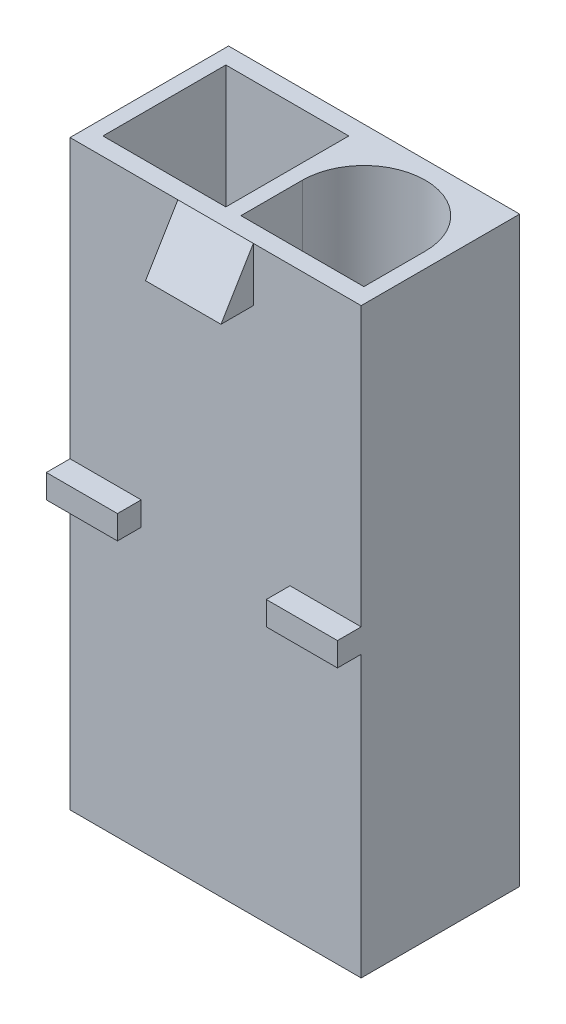
ISO-10303-21;
HEADER;
FILE_DESCRIPTION(('STEP AP214'),'2;1');
FILE_NAME('part.step','',(''),(''),'','','');
FILE_SCHEMA(('AUTOMOTIVE_DESIGN { 1 0 10303 214 1 1 1 1 }'));
ENDSEC;
DATA;
#1=APPLICATION_CONTEXT('core data for automotive mechanical design processes');
#2=APPLICATION_PROTOCOL_DEFINITION('international standard','automotive_design',2000,#1);
#3=PRODUCT_CONTEXT('',#1,'mechanical');
#4=PRODUCT('Part','Part','',(#3));
#5=PRODUCT_RELATED_PRODUCT_CATEGORY('part','',(#4));
#6=PRODUCT_DEFINITION_FORMATION('','',#4);
#7=PRODUCT_DEFINITION_CONTEXT('part definition',#1,'design');
#8=PRODUCT_DEFINITION('design','',#6,#7);
#9=PRODUCT_DEFINITION_SHAPE('','',#8);
#10=(LENGTH_UNIT() NAMED_UNIT(*) SI_UNIT(.MILLI.,.METRE.));
#11=(NAMED_UNIT(*) PLANE_ANGLE_UNIT() SI_UNIT($,.RADIAN.));
#12=(NAMED_UNIT(*) SI_UNIT($,.STERADIAN.) SOLID_ANGLE_UNIT());
#13=UNCERTAINTY_MEASURE_WITH_UNIT(LENGTH_MEASURE(1.E-05),#10,'distance_accuracy_value','');
#14=(GEOMETRIC_REPRESENTATION_CONTEXT(3) GLOBAL_UNCERTAINTY_ASSIGNED_CONTEXT((#13)) GLOBAL_UNIT_ASSIGNED_CONTEXT((#10,
#11,#12)) REPRESENTATION_CONTEXT('',''));
#15=CARTESIAN_POINT('',(0.,0.,0.));
#16=DIRECTION('',(0.,0.,1.));
#17=DIRECTION('',(1.,0.,0.));
#18=AXIS2_PLACEMENT_3D('',#15,#16,#17);
#19=CARTESIAN_POINT('',(0.,0.,3.675));
#20=DIRECTION('',(0.,0.,-1.));
#21=DIRECTION('',(-1.,0.,0.));
#22=AXIS2_PLACEMENT_3D('',#19,#20,#21);
#23=PLANE('',#22);
#24=DIRECTION('',(1.,0.,0.));
#25=VECTOR('',#24,1.);
#26=CARTESIAN_POINT('',(3.45,-0.499999999999999,3.675));
#27=LINE('',#26,#25);
#28=CARTESIAN_POINT('',(3.45,-0.499999999999999,3.675));
#29=VERTEX_POINT('',#28);
#30=CARTESIAN_POINT('',(6.75,-0.499999999999999,3.675));
#31=VERTEX_POINT('',#30);
#32=EDGE_CURVE('E48',#29,#31,#27,.T.);
#33=ORIENTED_EDGE('',*,*,#32,.F.);
#34=DIRECTION('',(0.,-1.,0.));
#35=VECTOR('',#34,1.);
#36=CARTESIAN_POINT('',(3.45,0.600000000000001,3.675));
#37=LINE('',#36,#35);
#38=CARTESIAN_POINT('',(3.45,0.600000000000001,3.675));
#39=VERTEX_POINT('',#38);
#40=EDGE_CURVE('E53',#39,#29,#37,.T.);
#41=ORIENTED_EDGE('',*,*,#40,.F.);
#42=DIRECTION('',(-1.,0.,0.));
#43=VECTOR('',#42,1.);
#44=CARTESIAN_POINT('',(3.45,0.600000000000001,3.675));
#45=LINE('',#44,#43);
#46=CARTESIAN_POINT('',(6.75,0.600000000000001,3.675));
#47=VERTEX_POINT('',#46);
#48=EDGE_CURVE('E230',#47,#39,#45,.T.);
#49=ORIENTED_EDGE('',*,*,#48,.F.);
#50=DIRECTION('',(0.,1.,0.));
#51=VECTOR('',#50,1.);
#52=CARTESIAN_POINT('',(6.75,-13.5,3.675));
#53=LINE('',#52,#51);
#54=CARTESIAN_POINT('',(6.75,13.5,3.675));
#55=VERTEX_POINT('',#54);
#56=EDGE_CURVE('E401',#47,#55,#53,.T.);
#57=ORIENTED_EDGE('',*,*,#56,.T.);
#58=DIRECTION('',(-1.,0.,0.));
#59=VECTOR('',#58,1.);
#60=CARTESIAN_POINT('',(-6.75,13.5,3.675));
#61=LINE('',#60,#59);
#62=CARTESIAN_POINT('',(1.75,13.5,3.675));
#63=VERTEX_POINT('',#62);
#64=EDGE_CURVE('E402',#55,#63,#61,.T.);
#65=ORIENTED_EDGE('',*,*,#64,.T.);
#66=DIRECTION('',(0.,1.,0.));
#67=VECTOR('',#66,1.);
#68=CARTESIAN_POINT('',(1.75,11.,3.675));
#69=LINE('',#68,#67);
#70=CARTESIAN_POINT('',(1.75,11.,3.675));
#71=VERTEX_POINT('',#70);
#72=EDGE_CURVE('E298',#71,#63,#69,.T.);
#73=ORIENTED_EDGE('',*,*,#72,.F.);
#74=DIRECTION('',(-1.,0.,0.));
#75=VECTOR('',#74,1.);
#76=CARTESIAN_POINT('',(1.75,11.,3.675));
#77=LINE('',#76,#75);
#78=CARTESIAN_POINT('',(-1.75,11.,3.675));
#79=VERTEX_POINT('',#78);
#80=EDGE_CURVE('E306',#71,#79,#77,.T.);
#81=ORIENTED_EDGE('',*,*,#80,.T.);
#82=DIRECTION('',(0.,1.,0.));
#83=VECTOR('',#82,1.);
#84=CARTESIAN_POINT('',(-1.75,11.,3.675));
#85=LINE('',#84,#83);
#86=CARTESIAN_POINT('',(-1.75,13.5,3.675));
#87=VERTEX_POINT('',#86);
#88=EDGE_CURVE('E297',#79,#87,#85,.T.);
#89=ORIENTED_EDGE('',*,*,#88,.T.);
#90=CARTESIAN_POINT('',(-6.75,13.5,3.675));
#91=VERTEX_POINT('',#90);
#92=EDGE_CURVE('E400',#87,#91,#61,.T.);
#93=ORIENTED_EDGE('',*,*,#92,.T.);
#94=DIRECTION('',(0.,-1.,0.));
#95=VECTOR('',#94,1.);
#96=CARTESIAN_POINT('',(-6.75,-13.5,3.675));
#97=LINE('',#96,#95);
#98=CARTESIAN_POINT('',(-6.75,0.600000000000002,3.675));
#99=VERTEX_POINT('',#98);
#100=EDGE_CURVE('E406',#91,#99,#97,.T.);
#101=ORIENTED_EDGE('',*,*,#100,.T.);
#102=DIRECTION('',(-1.,0.,0.));
#103=VECTOR('',#102,1.);
#104=CARTESIAN_POINT('',(-6.75,0.600000000000002,3.675));
#105=LINE('',#104,#103);
#106=CARTESIAN_POINT('',(-3.45,0.600000000000001,3.675));
#107=VERTEX_POINT('',#106);
#108=EDGE_CURVE('E246',#107,#99,#105,.T.);
#109=ORIENTED_EDGE('',*,*,#108,.F.);
#110=DIRECTION('',(0.,1.,0.));
#111=VECTOR('',#110,1.);
#112=CARTESIAN_POINT('',(-3.45,0.600000000000001,3.675));
#113=LINE('',#112,#111);
#114=CARTESIAN_POINT('',(-3.45,-0.499999999999999,3.675));
#115=VERTEX_POINT('',#114);
#116=EDGE_CURVE('E236',#115,#107,#113,.T.);
#117=ORIENTED_EDGE('',*,*,#116,.F.);
#118=DIRECTION('',(1.,0.,0.));
#119=VECTOR('',#118,1.);
#120=CARTESIAN_POINT('',(-6.75,-0.499999999999999,3.675));
#121=LINE('',#120,#119);
#122=CARTESIAN_POINT('',(-6.75,-0.499999999999999,3.675));
#123=VERTEX_POINT('',#122);
#124=EDGE_CURVE('E233',#123,#115,#121,.T.);
#125=ORIENTED_EDGE('',*,*,#124,.F.);
#126=CARTESIAN_POINT('',(-6.75,-13.5,3.675));
#127=VERTEX_POINT('',#126);
#128=EDGE_CURVE('E405',#123,#127,#97,.T.);
#129=ORIENTED_EDGE('',*,*,#128,.T.);
#130=DIRECTION('',(1.,0.,0.));
#131=VECTOR('',#130,1.);
#132=CARTESIAN_POINT('',(-6.75,-13.5,3.675));
#133=LINE('',#132,#131);
#134=CARTESIAN_POINT('',(6.75,-13.5,3.675));
#135=VERTEX_POINT('',#134);
#136=EDGE_CURVE('E408',#127,#135,#133,.T.);
#137=ORIENTED_EDGE('',*,*,#136,.T.);
#138=EDGE_CURVE('E398',#135,#31,#53,.T.);
#139=ORIENTED_EDGE('',*,*,#138,.T.);
#140=EDGE_LOOP('',(#33,#41,#49,#57,#65,#73,#81,#89,#93,#101,#109,#117,#125,#129,#137,#139));
#141=FACE_BOUND('',#140,.T.);
#142=ADVANCED_FACE('F33',(#141),#23,.F.);
#143=CARTESIAN_POINT('',(6.75,-13.5,3.675));
#144=DIRECTION('',(-1.,0.,0.));
#145=DIRECTION('',(0.,0.,1.));
#146=AXIS2_PLACEMENT_3D('',#143,#144,#145);
#147=PLANE('',#146);
#148=DIRECTION('',(0.,1.,0.));
#149=VECTOR('',#148,1.);
#150=CARTESIAN_POINT('',(6.75,-13.5,-3.675));
#151=LINE('',#150,#149);
#152=CARTESIAN_POINT('',(6.75,-13.5,-3.675));
#153=VERTEX_POINT('',#152);
#154=CARTESIAN_POINT('',(6.75,13.5,-3.675));
#155=VERTEX_POINT('',#154);
#156=EDGE_CURVE('E395',#153,#155,#151,.T.);
#157=ORIENTED_EDGE('',*,*,#156,.T.);
#158=DIRECTION('',(0.,0.,-1.));
#159=VECTOR('',#158,1.);
#160=CARTESIAN_POINT('',(6.75,13.5,3.675));
#161=LINE('',#160,#159);
#162=EDGE_CURVE('E11',#55,#155,#161,.T.);
#163=ORIENTED_EDGE('',*,*,#162,.F.);
#164=ORIENTED_EDGE('',*,*,#56,.F.);
#165=DIRECTION('',(0.,0.,-1.));
#166=VECTOR('',#165,1.);
#167=CARTESIAN_POINT('',(6.75,0.600000000000001,4.775));
#168=LINE('',#167,#166);
#169=CARTESIAN_POINT('',(6.75,0.600000000000001,4.775));
#170=VERTEX_POINT('',#169);
#171=EDGE_CURVE('E238',#170,#47,#168,.T.);
#172=ORIENTED_EDGE('',*,*,#171,.F.);
#173=DIRECTION('',(0.,1.,0.));
#174=VECTOR('',#173,1.);
#175=CARTESIAN_POINT('',(6.75,0.600000000000001,4.775));
#176=LINE('',#175,#174);
#177=CARTESIAN_POINT('',(6.75,-0.499999999999999,4.775));
#178=VERTEX_POINT('',#177);
#179=EDGE_CURVE('E220',#178,#170,#176,.T.);
#180=ORIENTED_EDGE('',*,*,#179,.F.);
#181=DIRECTION('',(0.,0.,-1.));
#182=VECTOR('',#181,1.);
#183=CARTESIAN_POINT('',(6.75,-0.499999999999999,4.775));
#184=LINE('',#183,#182);
#185=EDGE_CURVE('E217',#178,#31,#184,.T.);
#186=ORIENTED_EDGE('',*,*,#185,.T.);
#187=ORIENTED_EDGE('',*,*,#138,.F.);
#188=DIRECTION('',(0.,0.,-1.));
#189=VECTOR('',#188,1.);
#190=CARTESIAN_POINT('',(6.75,-13.5,3.675));
#191=LINE('',#190,#189);
#192=EDGE_CURVE('E410',#135,#153,#191,.T.);
#193=ORIENTED_EDGE('',*,*,#192,.T.);
#194=EDGE_LOOP('',(#157,#163,#164,#172,#180,#186,#187,#193));
#195=FACE_BOUND('',#194,.T.);
#196=ADVANCED_FACE('F35',(#195),#147,.F.);
#197=CARTESIAN_POINT('',(-6.75,13.5,3.675));
#198=DIRECTION('',(0.,-1.,0.));
#199=DIRECTION('',(0.,0.,-1.));
#200=AXIS2_PLACEMENT_3D('',#197,#198,#199);
#201=PLANE('',#200);
#202=CARTESIAN_POINT('',(3.2,13.5,0.));
#203=DIRECTION('',(0.,1.,0.));
#204=DIRECTION('',(0.,0.,1.));
#205=AXIS2_PLACEMENT_3D('',#202,#203,#204);
#206=CIRCLE('',#205,2.85);
#207=CARTESIAN_POINT('',(6.05,13.5,0.));
#208=VERTEX_POINT('',#207);
#209=CARTESIAN_POINT('',(0.350000000000001,13.5,0.));
#210=VERTEX_POINT('',#209);
#211=EDGE_CURVE('E337',#208,#210,#206,.T.);
#212=ORIENTED_EDGE('',*,*,#211,.F.);
#213=DIRECTION('',(0.,0.,-1.));
#214=VECTOR('',#213,1.);
#215=CARTESIAN_POINT('',(6.05,13.5,2.85));
#216=LINE('',#215,#214);
#217=CARTESIAN_POINT('',(6.05,13.5,2.85));
#218=VERTEX_POINT('',#217);
#219=EDGE_CURVE('E321',#218,#208,#216,.T.);
#220=ORIENTED_EDGE('',*,*,#219,.F.);
#221=DIRECTION('',(1.,0.,0.));
#222=VECTOR('',#221,1.);
#223=CARTESIAN_POINT('',(6.05,13.5,2.85));
#224=LINE('',#223,#222);
#225=CARTESIAN_POINT('',(0.35,13.5,2.85));
#226=VERTEX_POINT('',#225);
#227=EDGE_CURVE('E326',#226,#218,#224,.T.);
#228=ORIENTED_EDGE('',*,*,#227,.F.);
#229=DIRECTION('',(0.,0.,1.));
#230=VECTOR('',#229,1.);
#231=CARTESIAN_POINT('',(0.35,13.5,2.85));
#232=LINE('',#231,#230);
#233=EDGE_CURVE('E340',#210,#226,#232,.T.);
#234=ORIENTED_EDGE('',*,*,#233,.F.);
#235=EDGE_LOOP('',(#212,#220,#228,#234));
#236=FACE_BOUND('',#235,.T.);
#237=DIRECTION('',(1.,0.,0.));
#238=VECTOR('',#237,1.);
#239=CARTESIAN_POINT('',(-6.05,13.5,2.85));
#240=LINE('',#239,#238);
#241=CARTESIAN_POINT('',(-6.05,13.5,2.85));
#242=VERTEX_POINT('',#241);
#243=CARTESIAN_POINT('',(-0.349999999999999,13.5,2.85));
#244=VERTEX_POINT('',#243);
#245=EDGE_CURVE('E369',#242,#244,#240,.T.);
#246=ORIENTED_EDGE('',*,*,#245,.F.);
#247=DIRECTION('',(0.,0.,1.));
#248=VECTOR('',#247,1.);
#249=CARTESIAN_POINT('',(-6.05,13.5,2.85));
#250=LINE('',#249,#248);
#251=CARTESIAN_POINT('',(-6.05,13.5,-2.85));
#252=VERTEX_POINT('',#251);
#253=EDGE_CURVE('E347',#252,#242,#250,.T.);
#254=ORIENTED_EDGE('',*,*,#253,.F.);
#255=DIRECTION('',(-1.,0.,0.));
#256=VECTOR('',#255,1.);
#257=CARTESIAN_POINT('',(-6.05,13.5,-2.85));
#258=LINE('',#257,#256);
#259=CARTESIAN_POINT('',(-0.349999999999999,13.5,-2.85));
#260=VERTEX_POINT('',#259);
#261=EDGE_CURVE('E358',#260,#252,#258,.T.);
#262=ORIENTED_EDGE('',*,*,#261,.F.);
#263=DIRECTION('',(0.,0.,-1.));
#264=VECTOR('',#263,1.);
#265=CARTESIAN_POINT('',(-0.349999999999999,13.5,2.85));
#266=LINE('',#265,#264);
#267=EDGE_CURVE('E372',#244,#260,#266,.T.);
#268=ORIENTED_EDGE('',*,*,#267,.F.);
#269=EDGE_LOOP('',(#246,#254,#262,#268));
#270=FACE_BOUND('',#269,.T.);
#271=DIRECTION('',(-1.,0.,0.));
#272=VECTOR('',#271,1.);
#273=CARTESIAN_POINT('',(-6.75,13.5,-3.675));
#274=LINE('',#273,#272);
#275=CARTESIAN_POINT('',(-6.75,13.5,-3.675));
#276=VERTEX_POINT('',#275);
#277=EDGE_CURVE('E413',#155,#276,#274,.T.);
#278=ORIENTED_EDGE('',*,*,#277,.T.);
#279=DIRECTION('',(0.,0.,-1.));
#280=VECTOR('',#279,1.);
#281=CARTESIAN_POINT('',(-6.75,13.5,3.675));
#282=LINE('',#281,#280);
#283=EDGE_CURVE('E41',#91,#276,#282,.T.);
#284=ORIENTED_EDGE('',*,*,#283,.F.);
#285=ORIENTED_EDGE('',*,*,#92,.F.);
#286=DIRECTION('',(-1.,0.,0.));
#287=VECTOR('',#286,1.);
#288=CARTESIAN_POINT('',(1.75,13.5,3.675));
#289=LINE('',#288,#287);
#290=EDGE_CURVE('E318',#63,#87,#289,.T.);
#291=ORIENTED_EDGE('',*,*,#290,.F.);
#292=ORIENTED_EDGE('',*,*,#64,.F.);
#293=ORIENTED_EDGE('',*,*,#162,.T.);
#294=EDGE_LOOP('',(#278,#284,#285,#291,#292,#293));
#295=FACE_BOUND('',#294,.T.);
#296=ADVANCED_FACE('F456',(#236,#270,#295),#201,.F.);
#297=CARTESIAN_POINT('',(-6.75,-13.5,3.675));
#298=DIRECTION('',(1.,0.,0.));
#299=DIRECTION('',(0.,0.,-1.));
#300=AXIS2_PLACEMENT_3D('',#297,#298,#299);
#301=PLANE('',#300);
#302=DIRECTION('',(0.,-1.,0.));
#303=VECTOR('',#302,1.);
#304=CARTESIAN_POINT('',(-6.75,-13.5,-3.675));
#305=LINE('',#304,#303);
#306=CARTESIAN_POINT('',(-6.75,-13.5,-3.675));
#307=VERTEX_POINT('',#306);
#308=EDGE_CURVE('E415',#276,#307,#305,.T.);
#309=ORIENTED_EDGE('',*,*,#308,.T.);
#310=DIRECTION('',(0.,0.,-1.));
#311=VECTOR('',#310,1.);
#312=CARTESIAN_POINT('',(-6.75,-13.5,3.675));
#313=LINE('',#312,#311);
#314=EDGE_CURVE('E421',#127,#307,#313,.T.);
#315=ORIENTED_EDGE('',*,*,#314,.F.);
#316=ORIENTED_EDGE('',*,*,#128,.F.);
#317=DIRECTION('',(0.,0.,-1.));
#318=VECTOR('',#317,1.);
#319=CARTESIAN_POINT('',(-6.75,-0.499999999999999,4.775));
#320=LINE('',#319,#318);
#321=CARTESIAN_POINT('',(-6.75,-0.499999999999999,4.775));
#322=VERTEX_POINT('',#321);
#323=EDGE_CURVE('E265',#322,#123,#320,.T.);
#324=ORIENTED_EDGE('',*,*,#323,.F.);
#325=DIRECTION('',(0.,-1.,0.));
#326=VECTOR('',#325,1.);
#327=CARTESIAN_POINT('',(-6.75,0.600000000000002,4.775));
#328=LINE('',#327,#326);
#329=CARTESIAN_POINT('',(-6.75,0.600000000000002,4.775));
#330=VERTEX_POINT('',#329);
#331=EDGE_CURVE('E242',#330,#322,#328,.T.);
#332=ORIENTED_EDGE('',*,*,#331,.F.);
#333=DIRECTION('',(0.,0.,-1.));
#334=VECTOR('',#333,1.);
#335=CARTESIAN_POINT('',(-6.75,0.600000000000002,4.775));
#336=LINE('',#335,#334);
#337=EDGE_CURVE('E251',#330,#99,#336,.T.);
#338=ORIENTED_EDGE('',*,*,#337,.T.);
#339=ORIENTED_EDGE('',*,*,#100,.F.);
#340=ORIENTED_EDGE('',*,*,#283,.T.);
#341=EDGE_LOOP('',(#309,#315,#316,#324,#332,#338,#339,#340));
#342=FACE_BOUND('',#341,.T.);
#343=ADVANCED_FACE('F428',(#342),#301,.F.);
#344=CARTESIAN_POINT('',(-6.75,-13.5,3.675));
#345=DIRECTION('',(0.,1.,0.));
#346=DIRECTION('',(0.,0.,1.));
#347=AXIS2_PLACEMENT_3D('',#344,#345,#346);
#348=PLANE('',#347);
#349=CARTESIAN_POINT('',(3.,-13.5,0.));
#350=DIRECTION('',(0.,-1.,0.));
#351=DIRECTION('',(0.,0.,-1.));
#352=AXIS2_PLACEMENT_3D('',#349,#350,#351);
#353=CIRCLE('',#352,2.75);
#354=CARTESIAN_POINT('',(3.,-13.5,-2.75));
#355=VERTEX_POINT('',#354);
#356=EDGE_CURVE('E379',#355,#355,#353,.T.);
#357=ORIENTED_EDGE('',*,*,#356,.F.);
#358=EDGE_LOOP('',(#357));
#359=FACE_BOUND('',#358,.T.);
#360=CARTESIAN_POINT('',(-3.,-13.5,0.));
#361=DIRECTION('',(0.,-1.,0.));
#362=DIRECTION('',(0.,0.,-1.));
#363=AXIS2_PLACEMENT_3D('',#360,#361,#362);
#364=CIRCLE('',#363,2.75);
#365=CARTESIAN_POINT('',(-3.,-13.5,-2.75));
#366=VERTEX_POINT('',#365);
#367=EDGE_CURVE('E389',#366,#366,#364,.T.);
#368=ORIENTED_EDGE('',*,*,#367,.F.);
#369=EDGE_LOOP('',(#368));
#370=FACE_BOUND('',#369,.T.);
#371=DIRECTION('',(1.,0.,0.));
#372=VECTOR('',#371,1.);
#373=CARTESIAN_POINT('',(-6.75,-13.5,-3.675));
#374=LINE('',#373,#372);
#375=EDGE_CURVE('E417',#307,#153,#374,.T.);
#376=ORIENTED_EDGE('',*,*,#375,.T.);
#377=ORIENTED_EDGE('',*,*,#192,.F.);
#378=ORIENTED_EDGE('',*,*,#136,.F.);
#379=ORIENTED_EDGE('',*,*,#314,.T.);
#380=EDGE_LOOP('',(#376,#377,#378,#379));
#381=FACE_BOUND('',#380,.T.);
#382=ADVANCED_FACE('F438',(#359,#370,#381),#348,.F.);
#383=CARTESIAN_POINT('',(0.,0.,-3.675));
#384=DIRECTION('',(0.,0.,-1.));
#385=DIRECTION('',(-1.,0.,0.));
#386=AXIS2_PLACEMENT_3D('',#383,#384,#385);
#387=PLANE('',#386);
#388=DIRECTION('',(0.,-1.,0.));
#389=VECTOR('',#388,1.);
#390=CARTESIAN_POINT('',(4.5,0.900000000000003,-3.675));
#391=LINE('',#390,#389);
#392=CARTESIAN_POINT('',(4.5,0.900000000000003,-3.675));
#393=VERTEX_POINT('',#392);
#394=CARTESIAN_POINT('',(4.5,-0.199999999999997,-3.675));
#395=VERTEX_POINT('',#394);
#396=EDGE_CURVE('E269',#393,#395,#391,.T.);
#397=ORIENTED_EDGE('',*,*,#396,.F.);
#398=DIRECTION('',(-1.,0.,0.));
#399=VECTOR('',#398,1.);
#400=CARTESIAN_POINT('',(4.5,0.900000000000003,-3.675));
#401=LINE('',#400,#399);
#402=CARTESIAN_POINT('',(-4.5,0.900000000000003,-3.675));
#403=VERTEX_POINT('',#402);
#404=EDGE_CURVE('E279',#393,#403,#401,.T.);
#405=ORIENTED_EDGE('',*,*,#404,.T.);
#406=DIRECTION('',(0.,-1.,0.));
#407=VECTOR('',#406,1.);
#408=CARTESIAN_POINT('',(-4.5,0.900000000000003,-3.675));
#409=LINE('',#408,#407);
#410=CARTESIAN_POINT('',(-4.5,-0.199999999999997,-3.675));
#411=VERTEX_POINT('',#410);
#412=EDGE_CURVE('E268',#403,#411,#409,.T.);
#413=ORIENTED_EDGE('',*,*,#412,.T.);
#414=DIRECTION('',(-1.,0.,0.));
#415=VECTOR('',#414,1.);
#416=CARTESIAN_POINT('',(4.5,-0.199999999999997,-3.675));
#417=LINE('',#416,#415);
#418=EDGE_CURVE('E295',#395,#411,#417,.T.);
#419=ORIENTED_EDGE('',*,*,#418,.F.);
#420=EDGE_LOOP('',(#397,#405,#413,#419));
#421=FACE_BOUND('',#420,.T.);
#422=ORIENTED_EDGE('',*,*,#156,.F.);
#423=ORIENTED_EDGE('',*,*,#375,.F.);
#424=ORIENTED_EDGE('',*,*,#308,.F.);
#425=ORIENTED_EDGE('',*,*,#277,.F.);
#426=EDGE_LOOP('',(#422,#423,#424,#425));
#427=FACE_BOUND('',#426,.T.);
#428=ADVANCED_FACE('F435',(#421,#427),#387,.T.);
#429=CARTESIAN_POINT('',(-3.,-5.,0.));
#430=DIRECTION('',(0.,-1.,0.));
#431=DIRECTION('',(0.,0.,-1.));
#432=AXIS2_PLACEMENT_3D('',#429,#430,#431);
#433=CYLINDRICAL_SURFACE('',#432,2.75);
#434=CARTESIAN_POINT('',(-3.,-5.,0.));
#435=DIRECTION('',(0.,-1.,0.));
#436=DIRECTION('',(0.,0.,-1.));
#437=AXIS2_PLACEMENT_3D('',#434,#435,#436);
#438=CIRCLE('',#437,2.75);
#439=CARTESIAN_POINT('',(-3.,-5.,-2.75));
#440=VERTEX_POINT('',#439);
#441=EDGE_CURVE('E392',#440,#440,#438,.T.);
#442=ORIENTED_EDGE('',*,*,#441,.F.);
#443=EDGE_LOOP('',(#442));
#444=FACE_BOUND('',#443,.T.);
#445=ORIENTED_EDGE('',*,*,#367,.T.);
#446=EDGE_LOOP('',(#445));
#447=FACE_BOUND('',#446,.T.);
#448=ADVANCED_FACE('F488',(#444,#447),#433,.F.);
#449=CARTESIAN_POINT('',(-3.,-5.,0.));
#450=DIRECTION('',(0.,-1.,0.));
#451=DIRECTION('',(0.,0.,-1.));
#452=AXIS2_PLACEMENT_3D('',#449,#450,#451);
#453=PLANE('',#452);
#454=ORIENTED_EDGE('',*,*,#441,.T.);
#455=EDGE_LOOP('',(#454));
#456=FACE_BOUND('',#455,.T.);
#457=ADVANCED_FACE('F550',(#456),#453,.T.);
#458=CARTESIAN_POINT('',(3.,-5.,0.));
#459=DIRECTION('',(0.,-1.,0.));
#460=DIRECTION('',(0.,0.,-1.));
#461=AXIS2_PLACEMENT_3D('',#458,#459,#460);
#462=CYLINDRICAL_SURFACE('',#461,2.75);
#463=CARTESIAN_POINT('',(3.,-5.,0.));
#464=DIRECTION('',(0.,-1.,0.));
#465=DIRECTION('',(0.,0.,-1.));
#466=AXIS2_PLACEMENT_3D('',#463,#464,#465);
#467=CIRCLE('',#466,2.75);
#468=CARTESIAN_POINT('',(3.,-5.,-2.75));
#469=VERTEX_POINT('',#468);
#470=EDGE_CURVE('E386',#469,#469,#467,.T.);
#471=ORIENTED_EDGE('',*,*,#470,.F.);
#472=EDGE_LOOP('',(#471));
#473=FACE_BOUND('',#472,.T.);
#474=ORIENTED_EDGE('',*,*,#356,.T.);
#475=EDGE_LOOP('',(#474));
#476=FACE_BOUND('',#475,.T.);
#477=ADVANCED_FACE('F547',(#473,#476),#462,.F.);
#478=CARTESIAN_POINT('',(3.,-5.,0.));
#479=DIRECTION('',(0.,-1.,0.));
#480=DIRECTION('',(0.,0.,-1.));
#481=AXIS2_PLACEMENT_3D('',#478,#479,#480);
#482=PLANE('',#481);
#483=ORIENTED_EDGE('',*,*,#470,.T.);
#484=EDGE_LOOP('',(#483));
#485=FACE_BOUND('',#484,.T.);
#486=ADVANCED_FACE('F544',(#485),#482,.T.);
#487=CARTESIAN_POINT('',(-6.05,5.,2.85));
#488=DIRECTION('',(-1.,0.,0.));
#489=DIRECTION('',(0.,0.,1.));
#490=AXIS2_PLACEMENT_3D('',#487,#488,#489);
#491=PLANE('',#490);
#492=ORIENTED_EDGE('',*,*,#253,.T.);
#493=DIRECTION('',(0.,1.,0.));
#494=VECTOR('',#493,1.);
#495=CARTESIAN_POINT('',(-6.05,5.,2.85));
#496=LINE('',#495,#494);
#497=CARTESIAN_POINT('',(-6.05,5.,2.85));
#498=VERTEX_POINT('',#497);
#499=EDGE_CURVE('E367',#498,#242,#496,.T.);
#500=ORIENTED_EDGE('',*,*,#499,.F.);
#501=DIRECTION('',(0.,0.,1.));
#502=VECTOR('',#501,1.);
#503=CARTESIAN_POINT('',(-6.05,5.,2.85));
#504=LINE('',#503,#502);
#505=CARTESIAN_POINT('',(-6.05,5.,-2.85));
#506=VERTEX_POINT('',#505);
#507=EDGE_CURVE('E354',#506,#498,#504,.T.);
#508=ORIENTED_EDGE('',*,*,#507,.F.);
#509=DIRECTION('',(0.,1.,0.));
#510=VECTOR('',#509,1.);
#511=CARTESIAN_POINT('',(-6.05,5.,-2.85));
#512=LINE('',#511,#510);
#513=EDGE_CURVE('E377',#506,#252,#512,.T.);
#514=ORIENTED_EDGE('',*,*,#513,.T.);
#515=EDGE_LOOP('',(#492,#500,#508,#514));
#516=FACE_BOUND('',#515,.T.);
#517=ADVANCED_FACE('F517',(#516),#491,.F.);
#518=CARTESIAN_POINT('',(-6.05,5.,-2.85));
#519=DIRECTION('',(0.,0.,-1.));
#520=DIRECTION('',(-1.,0.,0.));
#521=AXIS2_PLACEMENT_3D('',#518,#519,#520);
#522=PLANE('',#521);
#523=ORIENTED_EDGE('',*,*,#261,.T.);
#524=ORIENTED_EDGE('',*,*,#513,.F.);
#525=DIRECTION('',(-1.,0.,0.));
#526=VECTOR('',#525,1.);
#527=CARTESIAN_POINT('',(-6.05,5.,-2.85));
#528=LINE('',#527,#526);
#529=CARTESIAN_POINT('',(-0.349999999999999,5.,-2.85));
#530=VERTEX_POINT('',#529);
#531=EDGE_CURVE('E364',#530,#506,#528,.T.);
#532=ORIENTED_EDGE('',*,*,#531,.F.);
#533=DIRECTION('',(0.,1.,0.));
#534=VECTOR('',#533,1.);
#535=CARTESIAN_POINT('',(-0.349999999999999,5.,-2.85));
#536=LINE('',#535,#534);
#537=EDGE_CURVE('E380',#530,#260,#536,.T.);
#538=ORIENTED_EDGE('',*,*,#537,.T.);
#539=EDGE_LOOP('',(#523,#524,#532,#538));
#540=FACE_BOUND('',#539,.T.);
#541=ADVANCED_FACE('F520',(#540),#522,.F.);
#542=CARTESIAN_POINT('',(-0.349999999999999,5.,2.85));
#543=DIRECTION('',(1.,0.,0.));
#544=DIRECTION('',(0.,0.,-1.));
#545=AXIS2_PLACEMENT_3D('',#542,#543,#544);
#546=PLANE('',#545);
#547=ORIENTED_EDGE('',*,*,#267,.T.);
#548=ORIENTED_EDGE('',*,*,#537,.F.);
#549=DIRECTION('',(0.,0.,-1.));
#550=VECTOR('',#549,1.);
#551=CARTESIAN_POINT('',(-0.349999999999999,5.,2.85));
#552=LINE('',#551,#550);
#553=CARTESIAN_POINT('',(-0.349999999999999,5.,2.85));
#554=VERTEX_POINT('',#553);
#555=EDGE_CURVE('E361',#554,#530,#552,.T.);
#556=ORIENTED_EDGE('',*,*,#555,.F.);
#557=DIRECTION('',(0.,1.,0.));
#558=VECTOR('',#557,1.);
#559=CARTESIAN_POINT('',(-0.349999999999999,5.,2.85));
#560=LINE('',#559,#558);
#561=EDGE_CURVE('E382',#554,#244,#560,.T.);
#562=ORIENTED_EDGE('',*,*,#561,.T.);
#563=EDGE_LOOP('',(#547,#548,#556,#562));
#564=FACE_BOUND('',#563,.T.);
#565=ADVANCED_FACE('F522',(#564),#546,.F.);
#566=CARTESIAN_POINT('',(-6.05,5.,2.85));
#567=DIRECTION('',(0.,0.,1.));
#568=DIRECTION('',(1.,0.,0.));
#569=AXIS2_PLACEMENT_3D('',#566,#567,#568);
#570=PLANE('',#569);
#571=ORIENTED_EDGE('',*,*,#245,.T.);
#572=ORIENTED_EDGE('',*,*,#561,.F.);
#573=DIRECTION('',(1.,0.,0.));
#574=VECTOR('',#573,1.);
#575=CARTESIAN_POINT('',(-6.05,5.,2.85));
#576=LINE('',#575,#574);
#577=EDGE_CURVE('E357',#498,#554,#576,.T.);
#578=ORIENTED_EDGE('',*,*,#577,.F.);
#579=ORIENTED_EDGE('',*,*,#499,.T.);
#580=EDGE_LOOP('',(#571,#572,#578,#579));
#581=FACE_BOUND('',#580,.T.);
#582=ADVANCED_FACE('F512',(#581),#570,.F.);
#583=CARTESIAN_POINT('',(0.,5.,0.));
#584=DIRECTION('',(0.,-1.,0.));
#585=DIRECTION('',(0.,0.,-1.));
#586=AXIS2_PLACEMENT_3D('',#583,#584,#585);
#587=PLANE('',#586);
#588=ORIENTED_EDGE('',*,*,#507,.T.);
#589=ORIENTED_EDGE('',*,*,#577,.T.);
#590=ORIENTED_EDGE('',*,*,#555,.T.);
#591=ORIENTED_EDGE('',*,*,#531,.T.);
#592=EDGE_LOOP('',(#588,#589,#590,#591));
#593=FACE_BOUND('',#592,.T.);
#594=ADVANCED_FACE('F524',(#593),#587,.F.);
#595=CARTESIAN_POINT('',(6.05,5.,2.85));
#596=DIRECTION('',(1.,0.,0.));
#597=DIRECTION('',(0.,0.,-1.));
#598=AXIS2_PLACEMENT_3D('',#595,#596,#597);
#599=PLANE('',#598);
#600=ORIENTED_EDGE('',*,*,#219,.T.);
#601=DIRECTION('',(0.,1.,0.));
#602=VECTOR('',#601,1.);
#603=CARTESIAN_POINT('',(6.05,5.,0.));
#604=LINE('',#603,#602);
#605=CARTESIAN_POINT('',(6.05,5.,0.));
#606=VERTEX_POINT('',#605);
#607=EDGE_CURVE('E335',#606,#208,#604,.T.);
#608=ORIENTED_EDGE('',*,*,#607,.F.);
#609=DIRECTION('',(0.,0.,-1.));
#610=VECTOR('',#609,1.);
#611=CARTESIAN_POINT('',(6.05,5.,2.85));
#612=LINE('',#611,#610);
#613=CARTESIAN_POINT('',(6.05,5.,2.85));
#614=VERTEX_POINT('',#613);
#615=EDGE_CURVE('E322',#614,#606,#612,.T.);
#616=ORIENTED_EDGE('',*,*,#615,.F.);
#617=DIRECTION('',(0.,1.,0.));
#618=VECTOR('',#617,1.);
#619=CARTESIAN_POINT('',(6.05,5.,2.85));
#620=LINE('',#619,#618);
#621=EDGE_CURVE('E345',#614,#218,#620,.T.);
#622=ORIENTED_EDGE('',*,*,#621,.T.);
#623=EDGE_LOOP('',(#600,#608,#616,#622));
#624=FACE_BOUND('',#623,.T.);
#625=ADVANCED_FACE('F526',(#624),#599,.F.);
#626=CARTESIAN_POINT('',(6.05,5.,2.85));
#627=DIRECTION('',(0.,0.,1.));
#628=DIRECTION('',(1.,0.,0.));
#629=AXIS2_PLACEMENT_3D('',#626,#627,#628);
#630=PLANE('',#629);
#631=ORIENTED_EDGE('',*,*,#227,.T.);
#632=ORIENTED_EDGE('',*,*,#621,.F.);
#633=DIRECTION('',(1.,0.,0.));
#634=VECTOR('',#633,1.);
#635=CARTESIAN_POINT('',(6.05,5.,2.85));
#636=LINE('',#635,#634);
#637=CARTESIAN_POINT('',(0.35,5.,2.85));
#638=VERTEX_POINT('',#637);
#639=EDGE_CURVE('E332',#638,#614,#636,.T.);
#640=ORIENTED_EDGE('',*,*,#639,.F.);
#641=DIRECTION('',(0.,1.,0.));
#642=VECTOR('',#641,1.);
#643=CARTESIAN_POINT('',(0.35,5.,2.85));
#644=LINE('',#643,#642);
#645=EDGE_CURVE('E348',#638,#226,#644,.T.);
#646=ORIENTED_EDGE('',*,*,#645,.T.);
#647=EDGE_LOOP('',(#631,#632,#640,#646));
#648=FACE_BOUND('',#647,.T.);
#649=ADVANCED_FACE('F532',(#648),#630,.F.);
#650=CARTESIAN_POINT('',(0.35,5.,2.85));
#651=DIRECTION('',(-1.,0.,0.));
#652=DIRECTION('',(0.,0.,1.));
#653=AXIS2_PLACEMENT_3D('',#650,#651,#652);
#654=PLANE('',#653);
#655=ORIENTED_EDGE('',*,*,#233,.T.);
#656=ORIENTED_EDGE('',*,*,#645,.F.);
#657=DIRECTION('',(0.,0.,1.));
#658=VECTOR('',#657,1.);
#659=CARTESIAN_POINT('',(0.35,5.,2.85));
#660=LINE('',#659,#658);
#661=CARTESIAN_POINT('',(0.350000000000001,5.,0.));
#662=VERTEX_POINT('',#661);
#663=EDGE_CURVE('E329',#662,#638,#660,.T.);
#664=ORIENTED_EDGE('',*,*,#663,.F.);
#665=DIRECTION('',(0.,1.,0.));
#666=VECTOR('',#665,1.);
#667=CARTESIAN_POINT('',(0.350000000000001,5.,0.));
#668=LINE('',#667,#666);
#669=EDGE_CURVE('E350',#662,#210,#668,.T.);
#670=ORIENTED_EDGE('',*,*,#669,.T.);
#671=EDGE_LOOP('',(#655,#656,#664,#670));
#672=FACE_BOUND('',#671,.T.);
#673=ADVANCED_FACE('F747',(#672),#654,.F.);
#674=CARTESIAN_POINT('',(3.2,5.,0.));
#675=DIRECTION('',(0.,1.,0.));
#676=DIRECTION('',(0.,0.,1.));
#677=AXIS2_PLACEMENT_3D('',#674,#675,#676);
#678=CYLINDRICAL_SURFACE('',#677,2.85);
#679=ORIENTED_EDGE('',*,*,#211,.T.);
#680=ORIENTED_EDGE('',*,*,#669,.F.);
#681=CARTESIAN_POINT('',(3.2,5.,0.));
#682=DIRECTION('',(0.,1.,0.));
#683=DIRECTION('',(0.,0.,1.));
#684=AXIS2_PLACEMENT_3D('',#681,#682,#683);
#685=CIRCLE('',#684,2.85);
#686=EDGE_CURVE('E325',#606,#662,#685,.T.);
#687=ORIENTED_EDGE('',*,*,#686,.F.);
#688=ORIENTED_EDGE('',*,*,#607,.T.);
#689=EDGE_LOOP('',(#679,#680,#687,#688));
#690=FACE_BOUND('',#689,.T.);
#691=ADVANCED_FACE('F740',(#690),#678,.F.);
#692=CARTESIAN_POINT('',(3.2,5.,0.));
#693=DIRECTION('',(0.,1.,0.));
#694=DIRECTION('',(0.,0.,1.));
#695=AXIS2_PLACEMENT_3D('',#692,#693,#694);
#696=PLANE('',#695);
#697=ORIENTED_EDGE('',*,*,#615,.T.);
#698=ORIENTED_EDGE('',*,*,#686,.T.);
#699=ORIENTED_EDGE('',*,*,#663,.T.);
#700=ORIENTED_EDGE('',*,*,#639,.T.);
#701=EDGE_LOOP('',(#697,#698,#699,#700));
#702=FACE_BOUND('',#701,.T.);
#703=ADVANCED_FACE('F725',(#702),#696,.T.);
#704=CARTESIAN_POINT('',(1.75,13.5,3.675));
#705=DIRECTION('',(0.,-0.514495755427526,-0.857492925712544));
#706=DIRECTION('',(0.,0.857492925712544,-0.514495755427526));
#707=AXIS2_PLACEMENT_3D('',#704,#705,#706);
#708=PLANE('',#707);
#709=DIRECTION('',(0.,-0.857492925712544,0.514495755427526));
#710=VECTOR('',#709,1.);
#711=CARTESIAN_POINT('',(-1.75,13.5,3.675));
#712=LINE('',#711,#710);
#713=CARTESIAN_POINT('',(-1.75,11.,5.175));
#714=VERTEX_POINT('',#713);
#715=EDGE_CURVE('E309',#87,#714,#712,.T.);
#716=ORIENTED_EDGE('',*,*,#715,.T.);
#717=DIRECTION('',(-1.,0.,0.));
#718=VECTOR('',#717,1.);
#719=CARTESIAN_POINT('',(1.75,11.,5.175));
#720=LINE('',#719,#718);
#721=CARTESIAN_POINT('',(1.75,11.,5.175));
#722=VERTEX_POINT('',#721);
#723=EDGE_CURVE('E315',#722,#714,#720,.T.);
#724=ORIENTED_EDGE('',*,*,#723,.F.);
#725=DIRECTION('',(0.,-0.857492925712544,0.514495755427526));
#726=VECTOR('',#725,1.);
#727=CARTESIAN_POINT('',(1.75,13.5,3.675));
#728=LINE('',#727,#726);
#729=EDGE_CURVE('E301',#63,#722,#728,.T.);
#730=ORIENTED_EDGE('',*,*,#729,.F.);
#731=ORIENTED_EDGE('',*,*,#290,.T.);
#732=EDGE_LOOP('',(#716,#724,#730,#731));
#733=FACE_BOUND('',#732,.T.);
#734=ADVANCED_FACE('F458',(#733),#708,.F.);
#735=CARTESIAN_POINT('',(1.75,11.,5.175));
#736=DIRECTION('',(0.,1.,0.));
#737=DIRECTION('',(0.,0.,1.));
#738=AXIS2_PLACEMENT_3D('',#735,#736,#737);
#739=PLANE('',#738);
#740=DIRECTION('',(0.,0.,-1.));
#741=VECTOR('',#740,1.);
#742=CARTESIAN_POINT('',(-1.75,11.,5.175));
#743=LINE('',#742,#741);
#744=EDGE_CURVE('E302',#714,#79,#743,.T.);
#745=ORIENTED_EDGE('',*,*,#744,.T.);
#746=ORIENTED_EDGE('',*,*,#80,.F.);
#747=DIRECTION('',(0.,0.,-1.));
#748=VECTOR('',#747,1.);
#749=CARTESIAN_POINT('',(1.75,11.,5.175));
#750=LINE('',#749,#748);
#751=EDGE_CURVE('E304',#722,#71,#750,.T.);
#752=ORIENTED_EDGE('',*,*,#751,.F.);
#753=ORIENTED_EDGE('',*,*,#723,.T.);
#754=EDGE_LOOP('',(#745,#746,#752,#753));
#755=FACE_BOUND('',#754,.T.);
#756=ADVANCED_FACE('F465',(#755),#739,.F.);
#757=CARTESIAN_POINT('',(1.75,0.,0.));
#758=DIRECTION('',(-1.,0.,0.));
#759=DIRECTION('',(0.,0.,1.));
#760=AXIS2_PLACEMENT_3D('',#757,#758,#759);
#761=PLANE('',#760);
#762=ORIENTED_EDGE('',*,*,#72,.T.);
#763=ORIENTED_EDGE('',*,*,#729,.T.);
#764=ORIENTED_EDGE('',*,*,#751,.T.);
#765=EDGE_LOOP('',(#762,#763,#764));
#766=FACE_BOUND('',#765,.T.);
#767=ADVANCED_FACE('F468',(#766),#761,.F.);
#768=CARTESIAN_POINT('',(-1.75,0.,0.));
#769=DIRECTION('',(-1.,0.,0.));
#770=DIRECTION('',(0.,0.,1.));
#771=AXIS2_PLACEMENT_3D('',#768,#769,#770);
#772=PLANE('',#771);
#773=ORIENTED_EDGE('',*,*,#88,.F.);
#774=ORIENTED_EDGE('',*,*,#744,.F.);
#775=ORIENTED_EDGE('',*,*,#715,.F.);
#776=EDGE_LOOP('',(#773,#774,#775));
#777=FACE_BOUND('',#776,.T.);
#778=ADVANCED_FACE('F463',(#777),#772,.T.);
#779=CARTESIAN_POINT('',(4.5,-0.199999999999997,-3.675));
#780=DIRECTION('',(0.,1.,0.));
#781=DIRECTION('',(0.,0.,1.));
#782=AXIS2_PLACEMENT_3D('',#779,#780,#781);
#783=PLANE('',#782);
#784=DIRECTION('',(0.,0.,-1.));
#785=VECTOR('',#784,1.);
#786=CARTESIAN_POINT('',(-4.5,-0.199999999999997,-3.675));
#787=LINE('',#786,#785);
#788=CARTESIAN_POINT('',(-4.5,-0.199999999999997,-4.775));
#789=VERTEX_POINT('',#788);
#790=EDGE_CURVE('E282',#411,#789,#787,.T.);
#791=ORIENTED_EDGE('',*,*,#790,.T.);
#792=DIRECTION('',(-1.,0.,0.));
#793=VECTOR('',#792,1.);
#794=CARTESIAN_POINT('',(4.5,-0.199999999999997,-4.775));
#795=LINE('',#794,#793);
#796=CARTESIAN_POINT('',(4.5,-0.199999999999997,-4.775));
#797=VERTEX_POINT('',#796);
#798=EDGE_CURVE('E292',#797,#789,#795,.T.);
#799=ORIENTED_EDGE('',*,*,#798,.F.);
#800=DIRECTION('',(0.,0.,-1.));
#801=VECTOR('',#800,1.);
#802=CARTESIAN_POINT('',(4.5,-0.199999999999997,-3.675));
#803=LINE('',#802,#801);
#804=EDGE_CURVE('E272',#395,#797,#803,.T.);
#805=ORIENTED_EDGE('',*,*,#804,.F.);
#806=ORIENTED_EDGE('',*,*,#418,.T.);
#807=EDGE_LOOP('',(#791,#799,#805,#806));
#808=FACE_BOUND('',#807,.T.);
#809=ADVANCED_FACE('F475',(#808),#783,.F.);
#810=CARTESIAN_POINT('',(4.5,0.900000000000003,-4.775));
#811=DIRECTION('',(0.,0.,1.));
#812=DIRECTION('',(1.,0.,0.));
#813=AXIS2_PLACEMENT_3D('',#810,#811,#812);
#814=PLANE('',#813);
#815=DIRECTION('',(0.,1.,0.));
#816=VECTOR('',#815,1.);
#817=CARTESIAN_POINT('',(-4.5,0.900000000000003,-4.775));
#818=LINE('',#817,#816);
#819=CARTESIAN_POINT('',(-4.5,0.900000000000003,-4.775));
#820=VERTEX_POINT('',#819);
#821=EDGE_CURVE('E284',#789,#820,#818,.T.);
#822=ORIENTED_EDGE('',*,*,#821,.T.);
#823=DIRECTION('',(-1.,0.,0.));
#824=VECTOR('',#823,1.);
#825=CARTESIAN_POINT('',(4.5,0.900000000000003,-4.775));
#826=LINE('',#825,#824);
#827=CARTESIAN_POINT('',(4.5,0.900000000000003,-4.775));
#828=VERTEX_POINT('',#827);
#829=EDGE_CURVE('E289',#828,#820,#826,.T.);
#830=ORIENTED_EDGE('',*,*,#829,.F.);
#831=DIRECTION('',(0.,1.,0.));
#832=VECTOR('',#831,1.);
#833=CARTESIAN_POINT('',(4.5,0.900000000000003,-4.775));
#834=LINE('',#833,#832);
#835=EDGE_CURVE('E275',#797,#828,#834,.T.);
#836=ORIENTED_EDGE('',*,*,#835,.F.);
#837=ORIENTED_EDGE('',*,*,#798,.T.);
#838=EDGE_LOOP('',(#822,#830,#836,#837));
#839=FACE_BOUND('',#838,.T.);
#840=ADVANCED_FACE('F691',(#839),#814,.F.);
#841=CARTESIAN_POINT('',(4.5,0.900000000000003,-3.675));
#842=DIRECTION('',(0.,-1.,0.));
#843=DIRECTION('',(0.,0.,-1.));
#844=AXIS2_PLACEMENT_3D('',#841,#842,#843);
#845=PLANE('',#844);
#846=DIRECTION('',(0.,0.,1.));
#847=VECTOR('',#846,1.);
#848=CARTESIAN_POINT('',(-4.5,0.900000000000003,-3.675));
#849=LINE('',#848,#847);
#850=EDGE_CURVE('E273',#820,#403,#849,.T.);
#851=ORIENTED_EDGE('',*,*,#850,.T.);
#852=ORIENTED_EDGE('',*,*,#404,.F.);
#853=DIRECTION('',(0.,0.,1.));
#854=VECTOR('',#853,1.);
#855=CARTESIAN_POINT('',(4.5,0.900000000000003,-3.675));
#856=LINE('',#855,#854);
#857=EDGE_CURVE('E277',#828,#393,#856,.T.);
#858=ORIENTED_EDGE('',*,*,#857,.F.);
#859=ORIENTED_EDGE('',*,*,#829,.T.);
#860=EDGE_LOOP('',(#851,#852,#858,#859));
#861=FACE_BOUND('',#860,.T.);
#862=ADVANCED_FACE('F683',(#861),#845,.F.);
#863=CARTESIAN_POINT('',(4.5,0.,0.));
#864=DIRECTION('',(1.,0.,0.));
#865=DIRECTION('',(0.,0.,-1.));
#866=AXIS2_PLACEMENT_3D('',#863,#864,#865);
#867=PLANE('',#866);
#868=ORIENTED_EDGE('',*,*,#396,.T.);
#869=ORIENTED_EDGE('',*,*,#804,.T.);
#870=ORIENTED_EDGE('',*,*,#835,.T.);
#871=ORIENTED_EDGE('',*,*,#857,.T.);
#872=EDGE_LOOP('',(#868,#869,#870,#871));
#873=FACE_BOUND('',#872,.T.);
#874=ADVANCED_FACE('F675',(#873),#867,.T.);
#875=CARTESIAN_POINT('',(-4.5,0.,0.));
#876=DIRECTION('',(1.,0.,0.));
#877=DIRECTION('',(0.,0.,-1.));
#878=AXIS2_PLACEMENT_3D('',#875,#876,#877);
#879=PLANE('',#878);
#880=ORIENTED_EDGE('',*,*,#412,.F.);
#881=ORIENTED_EDGE('',*,*,#850,.F.);
#882=ORIENTED_EDGE('',*,*,#821,.F.);
#883=ORIENTED_EDGE('',*,*,#790,.F.);
#884=EDGE_LOOP('',(#880,#881,#882,#883));
#885=FACE_BOUND('',#884,.T.);
#886=ADVANCED_FACE('F607',(#885),#879,.F.);
#887=CARTESIAN_POINT('',(-6.75,-0.499999999999999,4.775));
#888=DIRECTION('',(0.,1.,0.));
#889=DIRECTION('',(-1.,0.,0.));
#890=AXIS2_PLACEMENT_3D('',#887,#888,#889);
#891=PLANE('',#890);
#892=ORIENTED_EDGE('',*,*,#124,.T.);
#893=DIRECTION('',(0.,0.,-1.));
#894=VECTOR('',#893,1.);
#895=CARTESIAN_POINT('',(-3.45,-0.499999999999999,4.775));
#896=LINE('',#895,#894);
#897=CARTESIAN_POINT('',(-3.45,-0.499999999999999,4.775));
#898=VERTEX_POINT('',#897);
#899=EDGE_CURVE('E262',#898,#115,#896,.T.);
#900=ORIENTED_EDGE('',*,*,#899,.F.);
#901=DIRECTION('',(1.,0.,0.));
#902=VECTOR('',#901,1.);
#903=CARTESIAN_POINT('',(-6.75,-0.499999999999999,4.775));
#904=LINE('',#903,#902);
#905=EDGE_CURVE('E245',#322,#898,#904,.T.);
#906=ORIENTED_EDGE('',*,*,#905,.F.);
#907=ORIENTED_EDGE('',*,*,#323,.T.);
#908=EDGE_LOOP('',(#892,#900,#906,#907));
#909=FACE_BOUND('',#908,.T.);
#910=ADVANCED_FACE('F601',(#909),#891,.F.);
#911=CARTESIAN_POINT('',(-3.45,0.600000000000001,4.775));
#912=DIRECTION('',(-1.,0.,0.));
#913=DIRECTION('',(0.,0.,1.));
#914=AXIS2_PLACEMENT_3D('',#911,#912,#913);
#915=PLANE('',#914);
#916=ORIENTED_EDGE('',*,*,#116,.T.);
#917=DIRECTION('',(0.,0.,-1.));
#918=VECTOR('',#917,1.);
#919=CARTESIAN_POINT('',(-3.45,0.600000000000001,4.775));
#920=LINE('',#919,#918);
#921=CARTESIAN_POINT('',(-3.45,0.600000000000001,4.775));
#922=VERTEX_POINT('',#921);
#923=EDGE_CURVE('E259',#922,#107,#920,.T.);
#924=ORIENTED_EDGE('',*,*,#923,.F.);
#925=DIRECTION('',(0.,1.,0.));
#926=VECTOR('',#925,1.);
#927=CARTESIAN_POINT('',(-3.45,0.600000000000001,4.775));
#928=LINE('',#927,#926);
#929=EDGE_CURVE('E248',#898,#922,#928,.T.);
#930=ORIENTED_EDGE('',*,*,#929,.F.);
#931=ORIENTED_EDGE('',*,*,#899,.T.);
#932=EDGE_LOOP('',(#916,#924,#930,#931));
#933=FACE_BOUND('',#932,.T.);
#934=ADVANCED_FACE('F606',(#933),#915,.F.);
#935=CARTESIAN_POINT('',(-6.75,0.600000000000002,4.775));
#936=DIRECTION('',(0.,-1.,0.));
#937=DIRECTION('',(1.,0.,0.));
#938=AXIS2_PLACEMENT_3D('',#935,#936,#937);
#939=PLANE('',#938);
#940=ORIENTED_EDGE('',*,*,#108,.T.);
#941=ORIENTED_EDGE('',*,*,#337,.F.);
#942=DIRECTION('',(-1.,0.,0.));
#943=VECTOR('',#942,1.);
#944=CARTESIAN_POINT('',(-6.75,0.600000000000002,4.775));
#945=LINE('',#944,#943);
#946=EDGE_CURVE('E250',#922,#330,#945,.T.);
#947=ORIENTED_EDGE('',*,*,#946,.F.);
#948=ORIENTED_EDGE('',*,*,#923,.T.);
#949=EDGE_LOOP('',(#940,#941,#947,#948));
#950=FACE_BOUND('',#949,.T.);
#951=ADVANCED_FACE('F616',(#950),#939,.F.);
#952=CARTESIAN_POINT('',(0.,0.,4.775));
#953=DIRECTION('',(0.,0.,1.));
#954=DIRECTION('',(1.,0.,0.));
#955=AXIS2_PLACEMENT_3D('',#952,#953,#954);
#956=PLANE('',#955);
#957=ORIENTED_EDGE('',*,*,#331,.T.);
#958=ORIENTED_EDGE('',*,*,#905,.T.);
#959=ORIENTED_EDGE('',*,*,#929,.T.);
#960=ORIENTED_EDGE('',*,*,#946,.T.);
#961=EDGE_LOOP('',(#957,#958,#959,#960));
#962=FACE_BOUND('',#961,.T.);
#963=ADVANCED_FACE('F625',(#962),#956,.T.);
#964=CARTESIAN_POINT('',(3.45,0.600000000000001,4.775));
#965=DIRECTION('',(1.,0.,0.));
#966=DIRECTION('',(0.,0.,-1.));
#967=AXIS2_PLACEMENT_3D('',#964,#965,#966);
#968=PLANE('',#967);
#969=ORIENTED_EDGE('',*,*,#40,.T.);
#970=DIRECTION('',(0.,0.,-1.));
#971=VECTOR('',#970,1.);
#972=CARTESIAN_POINT('',(3.45,-0.499999999999999,4.775));
#973=LINE('',#972,#971);
#974=CARTESIAN_POINT('',(3.45,-0.499999999999999,4.775));
#975=VERTEX_POINT('',#974);
#976=EDGE_CURVE('E215',#975,#29,#973,.T.);
#977=ORIENTED_EDGE('',*,*,#976,.F.);
#978=DIRECTION('',(0.,-1.,0.));
#979=VECTOR('',#978,1.);
#980=CARTESIAN_POINT('',(3.45,0.600000000000001,4.775));
#981=LINE('',#980,#979);
#982=CARTESIAN_POINT('',(3.45,0.600000000000001,4.775));
#983=VERTEX_POINT('',#982);
#984=EDGE_CURVE('E221',#983,#975,#981,.T.);
#985=ORIENTED_EDGE('',*,*,#984,.F.);
#986=DIRECTION('',(0.,0.,-1.));
#987=VECTOR('',#986,1.);
#988=CARTESIAN_POINT('',(3.45,0.600000000000001,4.775));
#989=LINE('',#988,#987);
#990=EDGE_CURVE('E448',#983,#39,#989,.T.);
#991=ORIENTED_EDGE('',*,*,#990,.T.);
#992=EDGE_LOOP('',(#969,#977,#985,#991));
#993=FACE_BOUND('',#992,.T.);
#994=ADVANCED_FACE('F232',(#993),#968,.F.);
#995=CARTESIAN_POINT('',(3.45,-0.499999999999999,4.775));
#996=DIRECTION('',(0.,1.,0.));
#997=DIRECTION('',(0.,0.,1.));
#998=AXIS2_PLACEMENT_3D('',#995,#996,#997);
#999=PLANE('',#998);
#1000=ORIENTED_EDGE('',*,*,#32,.T.);
#1001=ORIENTED_EDGE('',*,*,#185,.F.);
#1002=DIRECTION('',(1.,0.,0.));
#1003=VECTOR('',#1002,1.);
#1004=CARTESIAN_POINT('',(3.45,-0.499999999999999,4.775));
#1005=LINE('',#1004,#1003);
#1006=EDGE_CURVE('E211',#975,#178,#1005,.T.);
#1007=ORIENTED_EDGE('',*,*,#1006,.F.);
#1008=ORIENTED_EDGE('',*,*,#976,.T.);
#1009=EDGE_LOOP('',(#1000,#1001,#1007,#1008));
#1010=FACE_BOUND('',#1009,.T.);
#1011=ADVANCED_FACE('F213',(#1010),#999,.F.);
#1012=CARTESIAN_POINT('',(3.45,0.600000000000001,4.775));
#1013=DIRECTION('',(0.,-1.,0.));
#1014=DIRECTION('',(0.,0.,-1.));
#1015=AXIS2_PLACEMENT_3D('',#1012,#1013,#1014);
#1016=PLANE('',#1015);
#1017=ORIENTED_EDGE('',*,*,#48,.T.);
#1018=ORIENTED_EDGE('',*,*,#990,.F.);
#1019=DIRECTION('',(-1.,0.,0.));
#1020=VECTOR('',#1019,1.);
#1021=CARTESIAN_POINT('',(3.45,0.600000000000001,4.775));
#1022=LINE('',#1021,#1020);
#1023=EDGE_CURVE('E226',#170,#983,#1022,.T.);
#1024=ORIENTED_EDGE('',*,*,#1023,.F.);
#1025=ORIENTED_EDGE('',*,*,#171,.T.);
#1026=EDGE_LOOP('',(#1017,#1018,#1024,#1025));
#1027=FACE_BOUND('',#1026,.T.);
#1028=ADVANCED_FACE('F452',(#1027),#1016,.F.);
#1029=CARTESIAN_POINT('',(0.,0.,4.775));
#1030=DIRECTION('',(0.,0.,1.));
#1031=DIRECTION('',(1.,0.,0.));
#1032=AXIS2_PLACEMENT_3D('',#1029,#1030,#1031);
#1033=PLANE('',#1032);
#1034=ORIENTED_EDGE('',*,*,#984,.T.);
#1035=ORIENTED_EDGE('',*,*,#1006,.T.);
#1036=ORIENTED_EDGE('',*,*,#179,.T.);
#1037=ORIENTED_EDGE('',*,*,#1023,.T.);
#1038=EDGE_LOOP('',(#1034,#1035,#1036,#1037));
#1039=FACE_BOUND('',#1038,.T.);
#1040=ADVANCED_FACE('F224',(#1039),#1033,.T.);
#1041=CLOSED_SHELL('',(#142,#196,#296,#343,#382,#428,#448,#457,#477,#486,#517,#541,#565,#582,
#594,#625,#649,#673,#691,#703,#734,#756,#767,#778,#809,#840,#862,#874,#886,#910,#934,#951,#963,
#994,#1011,#1028,#1040));
#1042=MANIFOLD_SOLID_BREP('B2',#1041);
#1043=ADVANCED_BREP_SHAPE_REPRESENTATION('',(#18,#1042),#14);
#1044=SHAPE_DEFINITION_REPRESENTATION(#9,#1043);
ENDSEC;
END-ISO-10303-21;
